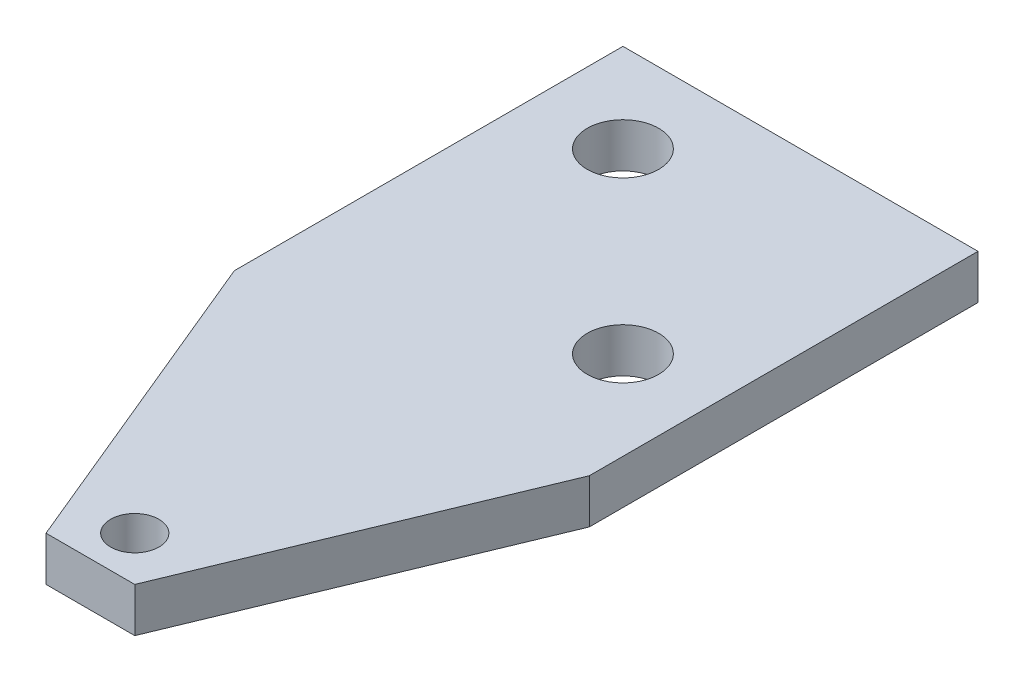
ISO-10303-21;
HEADER;
FILE_DESCRIPTION(('STEP AP214'),'2;1');
FILE_NAME('part.step','',(''),(''),'','','');
FILE_SCHEMA(('AUTOMOTIVE_DESIGN { 1 0 10303 214 1 1 1 1 }'));
ENDSEC;
DATA;
#1=APPLICATION_CONTEXT('core data for automotive mechanical design processes');
#2=APPLICATION_PROTOCOL_DEFINITION('international standard','automotive_design',2000,#1);
#3=PRODUCT_CONTEXT('',#1,'mechanical');
#4=PRODUCT('Part','Part','',(#3));
#5=PRODUCT_RELATED_PRODUCT_CATEGORY('part','',(#4));
#6=PRODUCT_DEFINITION_FORMATION('','',#4);
#7=PRODUCT_DEFINITION_CONTEXT('part definition',#1,'design');
#8=PRODUCT_DEFINITION('design','',#6,#7);
#9=PRODUCT_DEFINITION_SHAPE('','',#8);
#10=(LENGTH_UNIT() NAMED_UNIT(*) SI_UNIT(.MILLI.,.METRE.));
#11=(NAMED_UNIT(*) PLANE_ANGLE_UNIT() SI_UNIT($,.RADIAN.));
#12=(NAMED_UNIT(*) SI_UNIT($,.STERADIAN.) SOLID_ANGLE_UNIT());
#13=UNCERTAINTY_MEASURE_WITH_UNIT(LENGTH_MEASURE(1.E-05),#10,'distance_accuracy_value','');
#14=(GEOMETRIC_REPRESENTATION_CONTEXT(3) GLOBAL_UNCERTAINTY_ASSIGNED_CONTEXT((#13)) GLOBAL_UNIT_ASSIGNED_CONTEXT((#10,
#11,#12)) REPRESENTATION_CONTEXT('',''));
#15=CARTESIAN_POINT('',(0.,0.,0.));
#16=DIRECTION('',(0.,0.,1.));
#17=DIRECTION('',(1.,0.,0.));
#18=AXIS2_PLACEMENT_3D('',#15,#16,#17);
#19=CARTESIAN_POINT('',(0.,0.,0.));
#20=DIRECTION('',(0.,-1.,0.));
#21=DIRECTION('',(0.,0.,-1.));
#22=AXIS2_PLACEMENT_3D('',#19,#20,#21);
#23=PLANE('',#22);
#24=DIRECTION('',(1.,0.,0.));
#25=VECTOR('',#24,1.);
#26=CARTESIAN_POINT('',(-12.7,0.,-12.7));
#27=LINE('',#26,#25);
#28=CARTESIAN_POINT('',(-12.7,0.,-12.7));
#29=VERTEX_POINT('',#28);
#30=CARTESIAN_POINT('',(12.7,0.,-12.7));
#31=VERTEX_POINT('',#30);
#32=EDGE_CURVE('E119',#29,#31,#27,.T.);
#33=ORIENTED_EDGE('',*,*,#32,.T.);
#34=DIRECTION('',(0.,0.,-1.));
#35=VECTOR('',#34,1.);
#36=CARTESIAN_POINT('',(12.7,0.,15.1046158183968));
#37=LINE('',#36,#35);
#38=CARTESIAN_POINT('',(12.7,0.,15.1046158183968));
#39=VERTEX_POINT('',#38);
#40=EDGE_CURVE('E122',#39,#31,#37,.T.);
#41=ORIENTED_EDGE('',*,*,#40,.F.);
#42=DIRECTION('',(0.382683432365096,0.,-0.923879532511284));
#43=VECTOR('',#42,1.);
#44=CARTESIAN_POINT('',(3.17500000000001,0.,38.1000000000001));
#45=LINE('',#44,#43);
#46=CARTESIAN_POINT('',(3.17500000000001,0.,38.1000000000001));
#47=VERTEX_POINT('',#46);
#48=EDGE_CURVE('E125',#47,#39,#45,.T.);
#49=ORIENTED_EDGE('',*,*,#48,.F.);
#50=DIRECTION('',(1.,0.,0.));
#51=VECTOR('',#50,1.);
#52=CARTESIAN_POINT('',(-3.17499999999999,0.,38.1000000000001));
#53=LINE('',#52,#51);
#54=CARTESIAN_POINT('',(-3.17499999999999,0.,38.1000000000001));
#55=VERTEX_POINT('',#54);
#56=EDGE_CURVE('E127',#55,#47,#53,.T.);
#57=ORIENTED_EDGE('',*,*,#56,.F.);
#58=DIRECTION('',(0.382683432365097,0.,0.923879532511284));
#59=VECTOR('',#58,1.);
#60=CARTESIAN_POINT('',(-12.7,0.,15.1046158183968));
#61=LINE('',#60,#59);
#62=CARTESIAN_POINT('',(-12.7,0.,15.1046158183968));
#63=VERTEX_POINT('',#62);
#64=EDGE_CURVE('E104',#63,#55,#61,.T.);
#65=ORIENTED_EDGE('',*,*,#64,.F.);
#66=DIRECTION('',(0.,0.,1.));
#67=VECTOR('',#66,1.);
#68=CARTESIAN_POINT('',(-12.7,0.,-12.7));
#69=LINE('',#68,#67);
#70=EDGE_CURVE('E73',#29,#63,#69,.T.);
#71=ORIENTED_EDGE('',*,*,#70,.F.);
#72=EDGE_LOOP('',(#33,#41,#49,#57,#65,#71));
#73=FACE_BOUND('',#72,.T.);
#74=CARTESIAN_POINT('',(6.35,0.,6.35));
#75=DIRECTION('',(0.,1.,0.));
#76=DIRECTION('',(0.,0.,1.));
#77=AXIS2_PLACEMENT_3D('',#74,#75,#76);
#78=CIRCLE('',#77,2.5527);
#79=CARTESIAN_POINT('',(6.35,0.,8.9027));
#80=VERTEX_POINT('',#79);
#81=EDGE_CURVE('E123',#80,#80,#78,.T.);
#82=ORIENTED_EDGE('',*,*,#81,.T.);
#83=EDGE_LOOP('',(#82));
#84=FACE_BOUND('',#83,.T.);
#85=CARTESIAN_POINT('',(-6.35,0.,-6.35));
#86=DIRECTION('',(0.,1.,0.));
#87=DIRECTION('',(0.,0.,1.));
#88=AXIS2_PLACEMENT_3D('',#85,#86,#87);
#89=CIRCLE('',#88,2.5527);
#90=CARTESIAN_POINT('',(-6.35,0.,-3.7973));
#91=VERTEX_POINT('',#90);
#92=EDGE_CURVE('E152',#91,#91,#89,.T.);
#93=ORIENTED_EDGE('',*,*,#92,.T.);
#94=EDGE_LOOP('',(#93));
#95=FACE_BOUND('',#94,.T.);
#96=CARTESIAN_POINT('',(0.,0.,34.9250000000001));
#97=DIRECTION('',(0.,1.,0.));
#98=DIRECTION('',(0.,0.,1.));
#99=AXIS2_PLACEMENT_3D('',#96,#97,#98);
#100=CIRCLE('',#99,1.7272);
#101=CARTESIAN_POINT('',(0.,0.,36.6522000000001));
#102=VERTEX_POINT('',#101);
#103=EDGE_CURVE('E158',#102,#102,#100,.T.);
#104=ORIENTED_EDGE('',*,*,#103,.T.);
#105=EDGE_LOOP('',(#104));
#106=FACE_BOUND('',#105,.T.);
#107=ADVANCED_FACE('F35',(#73,#84,#95,#106),#23,.T.);
#108=CARTESIAN_POINT('',(-12.7,3.175,-12.7));
#109=DIRECTION('',(0.,0.,-1.));
#110=DIRECTION('',(-1.,0.,0.));
#111=AXIS2_PLACEMENT_3D('',#108,#109,#110);
#112=PLANE('',#111);
#113=ORIENTED_EDGE('',*,*,#32,.F.);
#114=DIRECTION('',(0.,-1.,0.));
#115=VECTOR('',#114,1.);
#116=CARTESIAN_POINT('',(-12.7,3.175,-12.7));
#117=LINE('',#116,#115);
#118=CARTESIAN_POINT('',(-12.7,3.175,-12.7));
#119=VERTEX_POINT('',#118);
#120=EDGE_CURVE('E11',#119,#29,#117,.T.);
#121=ORIENTED_EDGE('',*,*,#120,.F.);
#122=DIRECTION('',(1.,0.,0.));
#123=VECTOR('',#122,1.);
#124=CARTESIAN_POINT('',(-12.7,3.175,-12.7));
#125=LINE('',#124,#123);
#126=CARTESIAN_POINT('',(12.7,3.175,-12.7));
#127=VERTEX_POINT('',#126);
#128=EDGE_CURVE('E130',#119,#127,#125,.T.);
#129=ORIENTED_EDGE('',*,*,#128,.T.);
#130=DIRECTION('',(0.,-1.,0.));
#131=VECTOR('',#130,1.);
#132=CARTESIAN_POINT('',(12.7,3.175,-12.7));
#133=LINE('',#132,#131);
#134=EDGE_CURVE('E39',#127,#31,#133,.T.);
#135=ORIENTED_EDGE('',*,*,#134,.T.);
#136=EDGE_LOOP('',(#113,#121,#129,#135));
#137=FACE_BOUND('',#136,.T.);
#138=ADVANCED_FACE('F37',(#137),#112,.T.);
#139=CARTESIAN_POINT('',(-12.7,3.175,-12.7));
#140=DIRECTION('',(1.,0.,0.));
#141=DIRECTION('',(0.,0.,-1.));
#142=AXIS2_PLACEMENT_3D('',#139,#140,#141);
#143=PLANE('',#142);
#144=ORIENTED_EDGE('',*,*,#70,.T.);
#145=DIRECTION('',(0.,-1.,0.));
#146=VECTOR('',#145,1.);
#147=CARTESIAN_POINT('',(-12.7,3.175,15.1046158183968));
#148=LINE('',#147,#146);
#149=CARTESIAN_POINT('',(-12.7,3.175,15.1046158183968));
#150=VERTEX_POINT('',#149);
#151=EDGE_CURVE('E45',#150,#63,#148,.T.);
#152=ORIENTED_EDGE('',*,*,#151,.F.);
#153=DIRECTION('',(0.,0.,1.));
#154=VECTOR('',#153,1.);
#155=CARTESIAN_POINT('',(-12.7,3.175,12.7));
#156=LINE('',#155,#154);
#157=EDGE_CURVE('E53',#119,#150,#156,.T.);
#158=ORIENTED_EDGE('',*,*,#157,.F.);
#159=ORIENTED_EDGE('',*,*,#120,.T.);
#160=EDGE_LOOP('',(#144,#152,#158,#159));
#161=FACE_BOUND('',#160,.T.);
#162=ADVANCED_FACE('F191',(#161),#143,.F.);
#163=CARTESIAN_POINT('',(-12.7,3.175,15.1046158183968));
#164=DIRECTION('',(0.923879532511284,0.,-0.382683432365097));
#165=DIRECTION('',(-0.382683432365097,0.,-0.923879532511284));
#166=AXIS2_PLACEMENT_3D('',#163,#164,#165);
#167=PLANE('',#166);
#168=ORIENTED_EDGE('',*,*,#64,.T.);
#169=DIRECTION('',(0.,-1.,0.));
#170=VECTOR('',#169,1.);
#171=CARTESIAN_POINT('',(-3.17499999999999,3.175,38.1000000000001));
#172=LINE('',#171,#170);
#173=CARTESIAN_POINT('',(-3.17499999999999,3.175,38.1000000000001));
#174=VERTEX_POINT('',#173);
#175=EDGE_CURVE('E101',#174,#55,#172,.T.);
#176=ORIENTED_EDGE('',*,*,#175,.F.);
#177=DIRECTION('',(0.382683432365097,0.,0.923879532511284));
#178=VECTOR('',#177,1.);
#179=CARTESIAN_POINT('',(-12.7,3.175,15.1046158183968));
#180=LINE('',#179,#178);
#181=EDGE_CURVE('E90',#150,#174,#180,.T.);
#182=ORIENTED_EDGE('',*,*,#181,.F.);
#183=ORIENTED_EDGE('',*,*,#151,.T.);
#184=EDGE_LOOP('',(#168,#176,#182,#183));
#185=FACE_BOUND('',#184,.T.);
#186=ADVANCED_FACE('F102',(#185),#167,.F.);
#187=CARTESIAN_POINT('',(-3.17499999999999,3.175,38.1000000000001));
#188=DIRECTION('',(0.,0.,-1.));
#189=DIRECTION('',(-1.,0.,0.));
#190=AXIS2_PLACEMENT_3D('',#187,#188,#189);
#191=PLANE('',#190);
#192=ORIENTED_EDGE('',*,*,#56,.T.);
#193=DIRECTION('',(0.,-1.,0.));
#194=VECTOR('',#193,1.);
#195=CARTESIAN_POINT('',(3.17500000000001,3.175,38.1000000000001));
#196=LINE('',#195,#194);
#197=CARTESIAN_POINT('',(3.17500000000001,3.175,38.1000000000001));
#198=VERTEX_POINT('',#197);
#199=EDGE_CURVE('E107',#198,#47,#196,.T.);
#200=ORIENTED_EDGE('',*,*,#199,.F.);
#201=DIRECTION('',(1.,0.,0.));
#202=VECTOR('',#201,1.);
#203=CARTESIAN_POINT('',(-3.17499999999999,3.175,38.1000000000001));
#204=LINE('',#203,#202);
#205=EDGE_CURVE('E96',#174,#198,#204,.T.);
#206=ORIENTED_EDGE('',*,*,#205,.F.);
#207=ORIENTED_EDGE('',*,*,#175,.T.);
#208=EDGE_LOOP('',(#192,#200,#206,#207));
#209=FACE_BOUND('',#208,.T.);
#210=ADVANCED_FACE('F109',(#209),#191,.F.);
#211=CARTESIAN_POINT('',(3.17500000000001,3.175,38.1000000000001));
#212=DIRECTION('',(-0.923879532511284,0.,-0.382683432365096));
#213=DIRECTION('',(-0.382683432365096,0.,0.923879532511284));
#214=AXIS2_PLACEMENT_3D('',#211,#212,#213);
#215=PLANE('',#214);
#216=ORIENTED_EDGE('',*,*,#48,.T.);
#217=DIRECTION('',(0.,-1.,0.));
#218=VECTOR('',#217,1.);
#219=CARTESIAN_POINT('',(12.7,3.175,15.1046158183968));
#220=LINE('',#219,#218);
#221=CARTESIAN_POINT('',(12.7,3.175,15.1046158183968));
#222=VERTEX_POINT('',#221);
#223=EDGE_CURVE('E133',#222,#39,#220,.T.);
#224=ORIENTED_EDGE('',*,*,#223,.F.);
#225=DIRECTION('',(0.382683432365096,0.,-0.923879532511284));
#226=VECTOR('',#225,1.);
#227=CARTESIAN_POINT('',(3.17500000000001,3.175,38.1000000000001));
#228=LINE('',#227,#226);
#229=EDGE_CURVE('E112',#198,#222,#228,.T.);
#230=ORIENTED_EDGE('',*,*,#229,.F.);
#231=ORIENTED_EDGE('',*,*,#199,.T.);
#232=EDGE_LOOP('',(#216,#224,#230,#231));
#233=FACE_BOUND('',#232,.T.);
#234=ADVANCED_FACE('F144',(#233),#215,.F.);
#235=CARTESIAN_POINT('',(12.7,3.175,15.1046158183968));
#236=DIRECTION('',(-1.,0.,0.));
#237=DIRECTION('',(0.,0.,1.));
#238=AXIS2_PLACEMENT_3D('',#235,#236,#237);
#239=PLANE('',#238);
#240=ORIENTED_EDGE('',*,*,#40,.T.);
#241=ORIENTED_EDGE('',*,*,#134,.F.);
#242=DIRECTION('',(0.,0.,1.));
#243=VECTOR('',#242,1.);
#244=CARTESIAN_POINT('',(12.7,3.175,-12.7));
#245=LINE('',#244,#243);
#246=EDGE_CURVE('E114',#127,#222,#245,.T.);
#247=ORIENTED_EDGE('',*,*,#246,.T.);
#248=ORIENTED_EDGE('',*,*,#223,.T.);
#249=EDGE_LOOP('',(#240,#241,#247,#248));
#250=FACE_BOUND('',#249,.T.);
#251=ADVANCED_FACE('F170',(#250),#239,.F.);
#252=CARTESIAN_POINT('',(0.,3.175,0.));
#253=DIRECTION('',(0.,-1.,0.));
#254=DIRECTION('',(0.,0.,-1.));
#255=AXIS2_PLACEMENT_3D('',#252,#253,#254);
#256=PLANE('',#255);
#257=CARTESIAN_POINT('',(0.,3.175,34.9250000000001));
#258=DIRECTION('',(0.,1.,0.));
#259=DIRECTION('',(0.,0.,1.));
#260=AXIS2_PLACEMENT_3D('',#257,#258,#259);
#261=CIRCLE('',#260,1.7272);
#262=CARTESIAN_POINT('',(0.,3.175,36.6522000000001));
#263=VERTEX_POINT('',#262);
#264=EDGE_CURVE('E161',#263,#263,#261,.T.);
#265=ORIENTED_EDGE('',*,*,#264,.F.);
#266=EDGE_LOOP('',(#265));
#267=FACE_BOUND('',#266,.T.);
#268=CARTESIAN_POINT('',(-6.35,3.175,-6.35));
#269=DIRECTION('',(0.,1.,0.));
#270=DIRECTION('',(0.,0.,1.));
#271=AXIS2_PLACEMENT_3D('',#268,#269,#270);
#272=CIRCLE('',#271,2.55269999999999);
#273=CARTESIAN_POINT('',(-6.35,3.175,-3.79730000000001));
#274=VERTEX_POINT('',#273);
#275=EDGE_CURVE('E155',#274,#274,#272,.T.);
#276=ORIENTED_EDGE('',*,*,#275,.F.);
#277=EDGE_LOOP('',(#276));
#278=FACE_BOUND('',#277,.T.);
#279=CARTESIAN_POINT('',(6.35,3.175,6.35));
#280=DIRECTION('',(0.,1.,0.));
#281=DIRECTION('',(0.,0.,1.));
#282=AXIS2_PLACEMENT_3D('',#279,#280,#281);
#283=CIRCLE('',#282,2.55269999999999);
#284=CARTESIAN_POINT('',(6.35,3.175,8.90269999999999));
#285=VERTEX_POINT('',#284);
#286=EDGE_CURVE('E149',#285,#285,#283,.T.);
#287=ORIENTED_EDGE('',*,*,#286,.F.);
#288=EDGE_LOOP('',(#287));
#289=FACE_BOUND('',#288,.T.);
#290=ORIENTED_EDGE('',*,*,#128,.F.);
#291=ORIENTED_EDGE('',*,*,#157,.T.);
#292=ORIENTED_EDGE('',*,*,#181,.T.);
#293=ORIENTED_EDGE('',*,*,#205,.T.);
#294=ORIENTED_EDGE('',*,*,#229,.T.);
#295=ORIENTED_EDGE('',*,*,#246,.F.);
#296=EDGE_LOOP('',(#290,#291,#292,#293,#294,#295));
#297=FACE_BOUND('',#296,.T.);
#298=ADVANCED_FACE('F93',(#267,#278,#289,#297),#256,.F.);
#299=CARTESIAN_POINT('',(6.35,3.175,6.35));
#300=DIRECTION('',(0.,1.,0.));
#301=DIRECTION('',(0.,0.,1.));
#302=AXIS2_PLACEMENT_3D('',#299,#300,#301);
#303=CYLINDRICAL_SURFACE('',#302,2.55269999999999);
#304=ORIENTED_EDGE('',*,*,#81,.F.);
#305=EDGE_LOOP('',(#304));
#306=FACE_BOUND('',#305,.T.);
#307=ORIENTED_EDGE('',*,*,#286,.T.);
#308=EDGE_LOOP('',(#307));
#309=FACE_BOUND('',#308,.T.);
#310=ADVANCED_FACE('F169',(#306,#309),#303,.F.);
#311=CARTESIAN_POINT('',(-6.35,3.175,-6.35));
#312=DIRECTION('',(0.,1.,0.));
#313=DIRECTION('',(0.,0.,1.));
#314=AXIS2_PLACEMENT_3D('',#311,#312,#313);
#315=CYLINDRICAL_SURFACE('',#314,2.55269999999999);
#316=ORIENTED_EDGE('',*,*,#92,.F.);
#317=EDGE_LOOP('',(#316));
#318=FACE_BOUND('',#317,.T.);
#319=ORIENTED_EDGE('',*,*,#275,.T.);
#320=EDGE_LOOP('',(#319));
#321=FACE_BOUND('',#320,.T.);
#322=ADVANCED_FACE('F177',(#318,#321),#315,.F.);
#323=CARTESIAN_POINT('',(0.,3.175,34.9250000000001));
#324=DIRECTION('',(0.,1.,0.));
#325=DIRECTION('',(0.,0.,1.));
#326=AXIS2_PLACEMENT_3D('',#323,#324,#325);
#327=CYLINDRICAL_SURFACE('',#326,1.7272);
#328=ORIENTED_EDGE('',*,*,#103,.F.);
#329=EDGE_LOOP('',(#328));
#330=FACE_BOUND('',#329,.T.);
#331=ORIENTED_EDGE('',*,*,#264,.T.);
#332=EDGE_LOOP('',(#331));
#333=FACE_BOUND('',#332,.T.);
#334=ADVANCED_FACE('F165',(#330,#333),#327,.F.);
#335=CLOSED_SHELL('',(#107,#138,#162,#186,#210,#234,#251,#298,#310,#322,#334));
#336=MANIFOLD_SOLID_BREP('B2',#335);
#337=ADVANCED_BREP_SHAPE_REPRESENTATION('',(#18,#336),#14);
#338=SHAPE_DEFINITION_REPRESENTATION(#9,#337);
ENDSEC;
END-ISO-10303-21;
